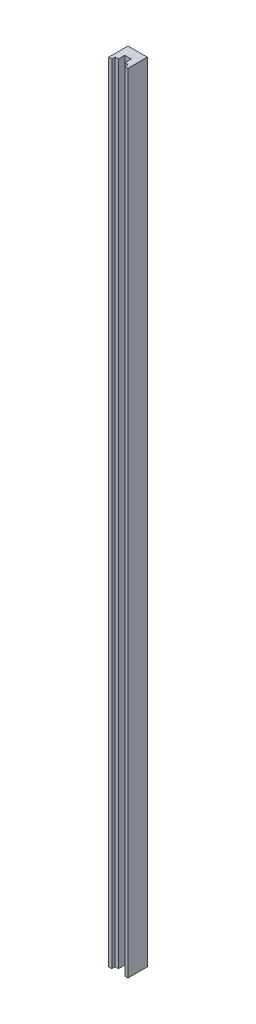
ISO-10303-21;
HEADER;
FILE_DESCRIPTION(('STEP AP214'),'2;1');
FILE_NAME('part.step','',(''),(''),'','','');
FILE_SCHEMA(('AUTOMOTIVE_DESIGN { 1 0 10303 214 1 1 1 1 }'));
ENDSEC;
DATA;
#1=APPLICATION_CONTEXT('core data for automotive mechanical design processes');
#2=APPLICATION_PROTOCOL_DEFINITION('international standard','automotive_design',2000,#1);
#3=PRODUCT_CONTEXT('',#1,'mechanical');
#4=PRODUCT('Part','Part','',(#3));
#5=PRODUCT_RELATED_PRODUCT_CATEGORY('part','',(#4));
#6=PRODUCT_DEFINITION_FORMATION('','',#4);
#7=PRODUCT_DEFINITION_CONTEXT('part definition',#1,'design');
#8=PRODUCT_DEFINITION('design','',#6,#7);
#9=PRODUCT_DEFINITION_SHAPE('','',#8);
#10=(LENGTH_UNIT() NAMED_UNIT(*) SI_UNIT(.MILLI.,.METRE.));
#11=(NAMED_UNIT(*) PLANE_ANGLE_UNIT() SI_UNIT($,.RADIAN.));
#12=(NAMED_UNIT(*) SI_UNIT($,.STERADIAN.) SOLID_ANGLE_UNIT());
#13=UNCERTAINTY_MEASURE_WITH_UNIT(LENGTH_MEASURE(1.E-05),#10,'distance_accuracy_value','');
#14=(GEOMETRIC_REPRESENTATION_CONTEXT(3) GLOBAL_UNCERTAINTY_ASSIGNED_CONTEXT((#13)) GLOBAL_UNIT_ASSIGNED_CONTEXT((#10,
#11,#12)) REPRESENTATION_CONTEXT('',''));
#15=CARTESIAN_POINT('',(0.,0.,0.));
#16=DIRECTION('',(0.,0.,1.));
#17=DIRECTION('',(1.,0.,0.));
#18=AXIS2_PLACEMENT_3D('',#15,#16,#17);
#19=CARTESIAN_POINT('',(-10.,-0.000999999999917733,9.99999999999999));
#20=DIRECTION('',(0.,0.,-1.));
#21=DIRECTION('',(-1.,0.,0.));
#22=AXIS2_PLACEMENT_3D('',#19,#20,#21);
#23=PLANE('',#22);
#24=DIRECTION('',(1.,0.,0.));
#25=VECTOR('',#24,1.);
#26=CARTESIAN_POINT('',(-10.,0.,9.99999999999999));
#27=LINE('',#26,#25);
#28=CARTESIAN_POINT('',(-10.,0.,9.99999999999999));
#29=VERTEX_POINT('',#28);
#30=CARTESIAN_POINT('',(-5.,0.,9.99999999999999));
#31=VERTEX_POINT('',#30);
#32=EDGE_CURVE('E143',#29,#31,#27,.T.);
#33=ORIENTED_EDGE('',*,*,#32,.T.);
#34=DIRECTION('',(0.,1.,0.));
#35=VECTOR('',#34,1.);
#36=CARTESIAN_POINT('',(-5.,-0.000999999999917733,9.99999999999999));
#37=LINE('',#36,#35);
#38=CARTESIAN_POINT('',(-5.,1225.,9.99999999999999));
#39=VERTEX_POINT('',#38);
#40=EDGE_CURVE('E126',#31,#39,#37,.T.);
#41=ORIENTED_EDGE('',*,*,#40,.T.);
#42=DIRECTION('',(-1.,0.,0.));
#43=VECTOR('',#42,1.);
#44=CARTESIAN_POINT('',(-10.,1225.,9.99999999999999));
#45=LINE('',#44,#43);
#46=CARTESIAN_POINT('',(-10.,1225.,9.99999999999999));
#47=VERTEX_POINT('',#46);
#48=EDGE_CURVE('E161',#39,#47,#45,.T.);
#49=ORIENTED_EDGE('',*,*,#48,.T.);
#50=DIRECTION('',(0.,1.,0.));
#51=VECTOR('',#50,1.);
#52=CARTESIAN_POINT('',(-10.,-0.000999999999917733,9.99999999999999));
#53=LINE('',#52,#51);
#54=EDGE_CURVE('E148',#29,#47,#53,.T.);
#55=ORIENTED_EDGE('',*,*,#54,.F.);
#56=EDGE_LOOP('',(#33,#41,#49,#55));
#57=FACE_BOUND('',#56,.T.);
#58=ADVANCED_FACE('F37',(#57),#23,.F.);
#59=CARTESIAN_POINT('',(15.,1225.,15.));
#60=DIRECTION('',(0.,0.,-1.));
#61=DIRECTION('',(-1.,0.,0.));
#62=AXIS2_PLACEMENT_3D('',#59,#60,#61);
#63=PLANE('',#62);
#64=DIRECTION('',(1.,0.,0.));
#65=VECTOR('',#64,1.);
#66=CARTESIAN_POINT('',(15.,0.,15.));
#67=LINE('',#66,#65);
#68=CARTESIAN_POINT('',(-15.,0.,15.));
#69=VERTEX_POINT('',#68);
#70=CARTESIAN_POINT('',(-10.,0.,15.));
#71=VERTEX_POINT('',#70);
#72=EDGE_CURVE('E190',#69,#71,#67,.T.);
#73=ORIENTED_EDGE('',*,*,#72,.T.);
#74=DIRECTION('',(0.,1.,0.));
#75=VECTOR('',#74,1.);
#76=CARTESIAN_POINT('',(-10.,-0.000999999999917733,15.));
#77=LINE('',#76,#75);
#78=CARTESIAN_POINT('',(-10.,1225.,15.));
#79=VERTEX_POINT('',#78);
#80=EDGE_CURVE('E165',#71,#79,#77,.T.);
#81=ORIENTED_EDGE('',*,*,#80,.T.);
#82=DIRECTION('',(1.,0.,0.));
#83=VECTOR('',#82,1.);
#84=CARTESIAN_POINT('',(15.,1225.,15.));
#85=LINE('',#84,#83);
#86=CARTESIAN_POINT('',(-15.,1225.,15.));
#87=VERTEX_POINT('',#86);
#88=EDGE_CURVE('E179',#87,#79,#85,.T.);
#89=ORIENTED_EDGE('',*,*,#88,.F.);
#90=DIRECTION('',(0.,-1.,0.));
#91=VECTOR('',#90,1.);
#92=CARTESIAN_POINT('',(-15.,1225.,15.));
#93=LINE('',#92,#91);
#94=EDGE_CURVE('E11',#87,#69,#93,.T.);
#95=ORIENTED_EDGE('',*,*,#94,.T.);
#96=EDGE_LOOP('',(#73,#81,#89,#95));
#97=FACE_BOUND('',#96,.T.);
#98=ADVANCED_FACE('F255',(#97),#63,.F.);
#99=CARTESIAN_POINT('',(-15.,1225.,15.));
#100=DIRECTION('',(1.,0.,0.));
#101=DIRECTION('',(0.,0.,-1.));
#102=AXIS2_PLACEMENT_3D('',#99,#100,#101);
#103=PLANE('',#102);
#104=DIRECTION('',(0.,0.,1.));
#105=VECTOR('',#104,1.);
#106=CARTESIAN_POINT('',(-15.,0.,15.));
#107=LINE('',#106,#105);
#108=CARTESIAN_POINT('',(-15.,0.,-15.));
#109=VERTEX_POINT('',#108);
#110=EDGE_CURVE('E167',#109,#69,#107,.T.);
#111=ORIENTED_EDGE('',*,*,#110,.T.);
#112=ORIENTED_EDGE('',*,*,#94,.F.);
#113=DIRECTION('',(0.,0.,1.));
#114=VECTOR('',#113,1.);
#115=CARTESIAN_POINT('',(-15.,1225.,15.));
#116=LINE('',#115,#114);
#117=CARTESIAN_POINT('',(-15.,1225.,-15.));
#118=VERTEX_POINT('',#117);
#119=EDGE_CURVE('E174',#118,#87,#116,.T.);
#120=ORIENTED_EDGE('',*,*,#119,.F.);
#121=DIRECTION('',(0.,-1.,0.));
#122=VECTOR('',#121,1.);
#123=CARTESIAN_POINT('',(-15.,1225.,-15.));
#124=LINE('',#123,#122);
#125=EDGE_CURVE('E186',#118,#109,#124,.T.);
#126=ORIENTED_EDGE('',*,*,#125,.T.);
#127=EDGE_LOOP('',(#111,#112,#120,#126));
#128=FACE_BOUND('',#127,.T.);
#129=ADVANCED_FACE('F39',(#128),#103,.F.);
#130=CARTESIAN_POINT('',(9.99999999999999,1225.,15.));
#131=VERTEX_POINT('',#130);
#132=CARTESIAN_POINT('',(15.,1225.,15.));
#133=VERTEX_POINT('',#132);
#134=EDGE_CURVE('E177',#131,#133,#85,.T.);
#135=ORIENTED_EDGE('',*,*,#134,.F.);
#136=DIRECTION('',(0.,1.,0.));
#137=VECTOR('',#136,1.);
#138=CARTESIAN_POINT('',(9.99999999999999,-0.000999999999917733,15.));
#139=LINE('',#138,#137);
#140=CARTESIAN_POINT('',(9.99999999999999,0.,15.));
#141=VERTEX_POINT('',#140);
#142=EDGE_CURVE('E170',#141,#131,#139,.T.);
#143=ORIENTED_EDGE('',*,*,#142,.F.);
#144=CARTESIAN_POINT('',(15.,0.,15.));
#145=VERTEX_POINT('',#144);
#146=EDGE_CURVE('E189',#141,#145,#67,.T.);
#147=ORIENTED_EDGE('',*,*,#146,.T.);
#148=DIRECTION('',(0.,-1.,0.));
#149=VECTOR('',#148,1.);
#150=CARTESIAN_POINT('',(15.,1225.,15.));
#151=LINE('',#150,#149);
#152=EDGE_CURVE('E45',#133,#145,#151,.T.);
#153=ORIENTED_EDGE('',*,*,#152,.F.);
#154=EDGE_LOOP('',(#135,#143,#147,#153));
#155=FACE_BOUND('',#154,.T.);
#156=ADVANCED_FACE('F226',(#155),#63,.F.);
#157=CARTESIAN_POINT('',(15.,1225.,15.));
#158=DIRECTION('',(-1.,0.,0.));
#159=DIRECTION('',(0.,0.,1.));
#160=AXIS2_PLACEMENT_3D('',#157,#158,#159);
#161=PLANE('',#160);
#162=DIRECTION('',(0.,0.,-1.));
#163=VECTOR('',#162,1.);
#164=CARTESIAN_POINT('',(15.,0.,15.));
#165=LINE('',#164,#163);
#166=CARTESIAN_POINT('',(15.,0.,-15.));
#167=VERTEX_POINT('',#166);
#168=EDGE_CURVE('E193',#145,#167,#165,.T.);
#169=ORIENTED_EDGE('',*,*,#168,.T.);
#170=DIRECTION('',(0.,-1.,0.));
#171=VECTOR('',#170,1.);
#172=CARTESIAN_POINT('',(15.,1225.,-15.));
#173=LINE('',#172,#171);
#174=CARTESIAN_POINT('',(15.,1225.,-15.));
#175=VERTEX_POINT('',#174);
#176=EDGE_CURVE('E198',#175,#167,#173,.T.);
#177=ORIENTED_EDGE('',*,*,#176,.F.);
#178=DIRECTION('',(0.,0.,-1.));
#179=VECTOR('',#178,1.);
#180=CARTESIAN_POINT('',(15.,1225.,15.));
#181=LINE('',#180,#179);
#182=EDGE_CURVE('E182',#133,#175,#181,.T.);
#183=ORIENTED_EDGE('',*,*,#182,.F.);
#184=ORIENTED_EDGE('',*,*,#152,.T.);
#185=EDGE_LOOP('',(#169,#177,#183,#184));
#186=FACE_BOUND('',#185,.T.);
#187=ADVANCED_FACE('F205',(#186),#161,.F.);
#188=CARTESIAN_POINT('',(15.,1225.,-15.));
#189=DIRECTION('',(0.,0.,1.));
#190=DIRECTION('',(1.,0.,0.));
#191=AXIS2_PLACEMENT_3D('',#188,#189,#190);
#192=PLANE('',#191);
#193=CARTESIAN_POINT('',(0.,75.,-15.));
#194=DIRECTION('',(0.,0.,-1.));
#195=DIRECTION('',(-1.,0.,0.));
#196=AXIS2_PLACEMENT_3D('',#193,#194,#195);
#197=CIRCLE('',#196,2.49999999999999);
#198=CARTESIAN_POINT('',(-2.49999999999999,75.,-15.));
#199=VERTEX_POINT('',#198);
#200=EDGE_CURVE('E655',#199,#199,#197,.T.);
#201=ORIENTED_EDGE('',*,*,#200,.F.);
#202=EDGE_LOOP('',(#201));
#203=FACE_BOUND('',#202,.T.);
#204=CARTESIAN_POINT('',(0.,25.,-15.));
#205=DIRECTION('',(0.,0.,-1.));
#206=DIRECTION('',(-1.,0.,0.));
#207=AXIS2_PLACEMENT_3D('',#204,#205,#206);
#208=CIRCLE('',#207,2.49999999999999);
#209=CARTESIAN_POINT('',(-2.5,25.,-15.));
#210=VERTEX_POINT('',#209);
#211=EDGE_CURVE('E657',#210,#210,#208,.T.);
#212=ORIENTED_EDGE('',*,*,#211,.F.);
#213=EDGE_LOOP('',(#212));
#214=FACE_BOUND('',#213,.T.);
#215=CARTESIAN_POINT('',(0.,250.,-15.));
#216=DIRECTION('',(0.,0.,-1.));
#217=DIRECTION('',(-1.,0.,0.));
#218=AXIS2_PLACEMENT_3D('',#215,#216,#217);
#219=CIRCLE('',#218,4.00000000000006);
#220=CARTESIAN_POINT('',(-4.00000000000007,250.,-15.));
#221=VERTEX_POINT('',#220);
#222=EDGE_CURVE('E665',#221,#221,#219,.T.);
#223=ORIENTED_EDGE('',*,*,#222,.F.);
#224=EDGE_LOOP('',(#223));
#225=FACE_BOUND('',#224,.T.);
#226=CARTESIAN_POINT('',(0.,300.,-15.));
#227=DIRECTION('',(0.,0.,-1.));
#228=DIRECTION('',(-1.,0.,0.));
#229=AXIS2_PLACEMENT_3D('',#226,#227,#228);
#230=CIRCLE('',#229,4.00000000000006);
#231=CARTESIAN_POINT('',(-4.00000000000007,300.,-15.));
#232=VERTEX_POINT('',#231);
#233=EDGE_CURVE('E669',#232,#232,#230,.T.);
#234=ORIENTED_EDGE('',*,*,#233,.F.);
#235=EDGE_LOOP('',(#234));
#236=FACE_BOUND('',#235,.T.);
#237=CARTESIAN_POINT('',(0.,350.,-15.));
#238=DIRECTION('',(0.,0.,-1.));
#239=DIRECTION('',(-1.,0.,0.));
#240=AXIS2_PLACEMENT_3D('',#237,#238,#239);
#241=CIRCLE('',#240,4.00000000000006);
#242=CARTESIAN_POINT('',(-4.00000000000007,350.,-15.));
#243=VERTEX_POINT('',#242);
#244=EDGE_CURVE('E675',#243,#243,#241,.T.);
#245=ORIENTED_EDGE('',*,*,#244,.F.);
#246=EDGE_LOOP('',(#245));
#247=FACE_BOUND('',#246,.T.);
#248=CARTESIAN_POINT('',(0.,400.,-15.));
#249=DIRECTION('',(0.,0.,-1.));
#250=DIRECTION('',(-1.,0.,0.));
#251=AXIS2_PLACEMENT_3D('',#248,#249,#250);
#252=CIRCLE('',#251,4.00000000000007);
#253=CARTESIAN_POINT('',(-4.00000000000008,400.,-15.));
#254=VERTEX_POINT('',#253);
#255=EDGE_CURVE('E681',#254,#254,#252,.T.);
#256=ORIENTED_EDGE('',*,*,#255,.F.);
#257=EDGE_LOOP('',(#256));
#258=FACE_BOUND('',#257,.T.);
#259=CARTESIAN_POINT('',(0.,450.,-15.));
#260=DIRECTION('',(0.,0.,-1.));
#261=DIRECTION('',(-1.,0.,0.));
#262=AXIS2_PLACEMENT_3D('',#259,#260,#261);
#263=CIRCLE('',#262,4.00000000000006);
#264=CARTESIAN_POINT('',(-4.00000000000007,450.,-15.));
#265=VERTEX_POINT('',#264);
#266=EDGE_CURVE('E687',#265,#265,#263,.T.);
#267=ORIENTED_EDGE('',*,*,#266,.F.);
#268=EDGE_LOOP('',(#267));
#269=FACE_BOUND('',#268,.T.);
#270=CARTESIAN_POINT('',(0.,500.,-15.));
#271=DIRECTION('',(0.,0.,-1.));
#272=DIRECTION('',(-1.,0.,0.));
#273=AXIS2_PLACEMENT_3D('',#270,#271,#272);
#274=CIRCLE('',#273,4.00000000000008);
#275=CARTESIAN_POINT('',(-4.00000000000008,500.,-15.));
#276=VERTEX_POINT('',#275);
#277=EDGE_CURVE('E693',#276,#276,#274,.T.);
#278=ORIENTED_EDGE('',*,*,#277,.F.);
#279=EDGE_LOOP('',(#278));
#280=FACE_BOUND('',#279,.T.);
#281=CARTESIAN_POINT('',(0.,550.,-15.));
#282=DIRECTION('',(0.,0.,-1.));
#283=DIRECTION('',(-1.,0.,0.));
#284=AXIS2_PLACEMENT_3D('',#281,#282,#283);
#285=CIRCLE('',#284,4.00000000000006);
#286=CARTESIAN_POINT('',(-4.00000000000007,550.,-15.));
#287=VERTEX_POINT('',#286);
#288=EDGE_CURVE('E699',#287,#287,#285,.T.);
#289=ORIENTED_EDGE('',*,*,#288,.F.);
#290=EDGE_LOOP('',(#289));
#291=FACE_BOUND('',#290,.T.);
#292=CARTESIAN_POINT('',(0.,600.,-15.));
#293=DIRECTION('',(0.,0.,-1.));
#294=DIRECTION('',(-1.,0.,0.));
#295=AXIS2_PLACEMENT_3D('',#292,#293,#294);
#296=CIRCLE('',#295,4.00000000000006);
#297=CARTESIAN_POINT('',(-4.00000000000007,600.,-15.));
#298=VERTEX_POINT('',#297);
#299=EDGE_CURVE('E705',#298,#298,#296,.T.);
#300=ORIENTED_EDGE('',*,*,#299,.F.);
#301=EDGE_LOOP('',(#300));
#302=FACE_BOUND('',#301,.T.);
#303=CARTESIAN_POINT('',(0.,650.,-15.));
#304=DIRECTION('',(0.,0.,-1.));
#305=DIRECTION('',(-1.,0.,0.));
#306=AXIS2_PLACEMENT_3D('',#303,#304,#305);
#307=CIRCLE('',#306,4.00000000000006);
#308=CARTESIAN_POINT('',(-4.00000000000007,650.,-15.));
#309=VERTEX_POINT('',#308);
#310=EDGE_CURVE('E711',#309,#309,#307,.T.);
#311=ORIENTED_EDGE('',*,*,#310,.F.);
#312=EDGE_LOOP('',(#311));
#313=FACE_BOUND('',#312,.T.);
#314=CARTESIAN_POINT('',(0.,700.,-15.));
#315=DIRECTION('',(0.,0.,-1.));
#316=DIRECTION('',(-1.,0.,0.));
#317=AXIS2_PLACEMENT_3D('',#314,#315,#316);
#318=CIRCLE('',#317,4.00000000000007);
#319=CARTESIAN_POINT('',(-4.00000000000008,700.,-15.));
#320=VERTEX_POINT('',#319);
#321=EDGE_CURVE('E717',#320,#320,#318,.T.);
#322=ORIENTED_EDGE('',*,*,#321,.F.);
#323=EDGE_LOOP('',(#322));
#324=FACE_BOUND('',#323,.T.);
#325=CARTESIAN_POINT('',(0.,800.,-15.));
#326=DIRECTION('',(0.,0.,-1.));
#327=DIRECTION('',(-1.,0.,0.));
#328=AXIS2_PLACEMENT_3D('',#325,#326,#327);
#329=CIRCLE('',#328,4.00000000000007);
#330=CARTESIAN_POINT('',(-4.00000000000008,800.,-15.));
#331=VERTEX_POINT('',#330);
#332=EDGE_CURVE('E723',#331,#331,#329,.T.);
#333=ORIENTED_EDGE('',*,*,#332,.F.);
#334=EDGE_LOOP('',(#333));
#335=FACE_BOUND('',#334,.T.);
#336=CARTESIAN_POINT('',(0.,200.,-15.));
#337=DIRECTION('',(0.,0.,-1.));
#338=DIRECTION('',(-1.,0.,0.));
#339=AXIS2_PLACEMENT_3D('',#336,#337,#338);
#340=CIRCLE('',#339,4.00000000000007);
#341=CARTESIAN_POINT('',(-4.00000000000008,200.,-15.));
#342=VERTEX_POINT('',#341);
#343=EDGE_CURVE('E729',#342,#342,#340,.T.);
#344=ORIENTED_EDGE('',*,*,#343,.F.);
#345=EDGE_LOOP('',(#344));
#346=FACE_BOUND('',#345,.T.);
#347=CARTESIAN_POINT('',(0.,1000.,-15.));
#348=DIRECTION('',(0.,0.,-1.));
#349=DIRECTION('',(-1.,0.,0.));
#350=AXIS2_PLACEMENT_3D('',#347,#348,#349);
#351=CIRCLE('',#350,4.00000000000007);
#352=CARTESIAN_POINT('',(-4.00000000000008,1000.,-15.));
#353=VERTEX_POINT('',#352);
#354=EDGE_CURVE('E735',#353,#353,#351,.T.);
#355=ORIENTED_EDGE('',*,*,#354,.F.);
#356=EDGE_LOOP('',(#355));
#357=FACE_BOUND('',#356,.T.);
#358=CARTESIAN_POINT('',(0.,1200.,-15.));
#359=DIRECTION('',(0.,0.,-1.));
#360=DIRECTION('',(-1.,0.,0.));
#361=AXIS2_PLACEMENT_3D('',#358,#359,#360);
#362=CIRCLE('',#361,4.00000000000006);
#363=CARTESIAN_POINT('',(-4.00000000000007,1200.,-15.));
#364=VERTEX_POINT('',#363);
#365=EDGE_CURVE('E741',#364,#364,#362,.T.);
#366=ORIENTED_EDGE('',*,*,#365,.F.);
#367=EDGE_LOOP('',(#366));
#368=FACE_BOUND('',#367,.T.);
#369=DIRECTION('',(-1.,0.,0.));
#370=VECTOR('',#369,1.);
#371=CARTESIAN_POINT('',(15.,0.,-15.));
#372=LINE('',#371,#370);
#373=EDGE_CURVE('E178',#167,#109,#372,.T.);
#374=ORIENTED_EDGE('',*,*,#373,.T.);
#375=ORIENTED_EDGE('',*,*,#125,.F.);
#376=DIRECTION('',(-1.,0.,0.));
#377=VECTOR('',#376,1.);
#378=CARTESIAN_POINT('',(15.,1225.,-15.));
#379=LINE('',#378,#377);
#380=EDGE_CURVE('E184',#175,#118,#379,.T.);
#381=ORIENTED_EDGE('',*,*,#380,.F.);
#382=ORIENTED_EDGE('',*,*,#176,.T.);
#383=EDGE_LOOP('',(#374,#375,#381,#382));
#384=FACE_BOUND('',#383,.T.);
#385=ADVANCED_FACE('F215',(#203,#214,#225,#236,#247,#258,#269,#280,#291,#302,#313,#324,#335,
#346,#357,#368,#384),#192,.F.);
#386=CARTESIAN_POINT('',(-15.,1225.,-15.));
#387=DIRECTION('',(0.,1.,0.));
#388=DIRECTION('',(0.,0.,1.));
#389=AXIS2_PLACEMENT_3D('',#386,#387,#388);
#390=PLANE('',#389);
#391=DIRECTION('',(0.,0.,1.));
#392=VECTOR('',#391,1.);
#393=CARTESIAN_POINT('',(-5.,1225.,9.99999999999999));
#394=LINE('',#393,#392);
#395=CARTESIAN_POINT('',(-5.00000000000001,1225.,0.));
#396=VERTEX_POINT('',#395);
#397=EDGE_CURVE('E132',#396,#39,#394,.T.);
#398=ORIENTED_EDGE('',*,*,#397,.F.);
#399=DIRECTION('',(-1.,0.,0.));
#400=VECTOR('',#399,1.);
#401=CARTESIAN_POINT('',(-5.00000000000001,1225.,0.));
#402=LINE('',#401,#400);
#403=CARTESIAN_POINT('',(4.99999999999999,1225.,0.));
#404=VERTEX_POINT('',#403);
#405=EDGE_CURVE('E137',#404,#396,#402,.T.);
#406=ORIENTED_EDGE('',*,*,#405,.F.);
#407=DIRECTION('',(0.,0.,-1.));
#408=VECTOR('',#407,1.);
#409=CARTESIAN_POINT('',(4.99999999999999,1225.,9.99999999999999));
#410=LINE('',#409,#408);
#411=CARTESIAN_POINT('',(4.99999999999999,1225.,9.99999999999999));
#412=VERTEX_POINT('',#411);
#413=EDGE_CURVE('E240',#412,#404,#410,.T.);
#414=ORIENTED_EDGE('',*,*,#413,.F.);
#415=CARTESIAN_POINT('',(9.99999999999999,1225.,9.99999999999999));
#416=VERTEX_POINT('',#415);
#417=EDGE_CURVE('E162',#416,#412,#45,.T.);
#418=ORIENTED_EDGE('',*,*,#417,.F.);
#419=DIRECTION('',(0.,0.,-1.));
#420=VECTOR('',#419,1.);
#421=CARTESIAN_POINT('',(9.99999999999999,1225.,15.));
#422=LINE('',#421,#420);
#423=EDGE_CURVE('E158',#131,#416,#422,.T.);
#424=ORIENTED_EDGE('',*,*,#423,.F.);
#425=ORIENTED_EDGE('',*,*,#134,.T.);
#426=ORIENTED_EDGE('',*,*,#182,.T.);
#427=ORIENTED_EDGE('',*,*,#380,.T.);
#428=ORIENTED_EDGE('',*,*,#119,.T.);
#429=ORIENTED_EDGE('',*,*,#88,.T.);
#430=DIRECTION('',(0.,0.,1.));
#431=VECTOR('',#430,1.);
#432=CARTESIAN_POINT('',(-10.,1225.,15.));
#433=LINE('',#432,#431);
#434=EDGE_CURVE('E152',#47,#79,#433,.T.);
#435=ORIENTED_EDGE('',*,*,#434,.F.);
#436=ORIENTED_EDGE('',*,*,#48,.F.);
#437=EDGE_LOOP('',(#398,#406,#414,#418,#424,#425,#426,#427,#428,#429,#435,#436));
#438=FACE_BOUND('',#437,.T.);
#439=ADVANCED_FACE('F221',(#438),#390,.T.);
#440=CARTESIAN_POINT('',(-15.,0.,-15.));
#441=DIRECTION('',(0.,1.,0.));
#442=DIRECTION('',(0.,0.,1.));
#443=AXIS2_PLACEMENT_3D('',#440,#441,#442);
#444=PLANE('',#443);
#445=DIRECTION('',(1.,0.,0.));
#446=VECTOR('',#445,1.);
#447=CARTESIAN_POINT('',(-5.00000000000001,0.,0.));
#448=LINE('',#447,#446);
#449=CARTESIAN_POINT('',(-5.00000000000001,0.,0.));
#450=VERTEX_POINT('',#449);
#451=CARTESIAN_POINT('',(4.99999999999999,0.,0.));
#452=VERTEX_POINT('',#451);
#453=EDGE_CURVE('E145',#450,#452,#448,.T.);
#454=ORIENTED_EDGE('',*,*,#453,.F.);
#455=DIRECTION('',(0.,0.,-1.));
#456=VECTOR('',#455,1.);
#457=CARTESIAN_POINT('',(-5.,0.,9.99999999999999));
#458=LINE('',#457,#456);
#459=EDGE_CURVE('E129',#31,#450,#458,.T.);
#460=ORIENTED_EDGE('',*,*,#459,.F.);
#461=ORIENTED_EDGE('',*,*,#32,.F.);
#462=DIRECTION('',(0.,0.,-1.));
#463=VECTOR('',#462,1.);
#464=CARTESIAN_POINT('',(-10.,0.,15.));
#465=LINE('',#464,#463);
#466=EDGE_CURVE('E150',#71,#29,#465,.T.);
#467=ORIENTED_EDGE('',*,*,#466,.F.);
#468=ORIENTED_EDGE('',*,*,#72,.F.);
#469=ORIENTED_EDGE('',*,*,#110,.F.);
#470=ORIENTED_EDGE('',*,*,#373,.F.);
#471=ORIENTED_EDGE('',*,*,#168,.F.);
#472=ORIENTED_EDGE('',*,*,#146,.F.);
#473=DIRECTION('',(0.,0.,1.));
#474=VECTOR('',#473,1.);
#475=CARTESIAN_POINT('',(9.99999999999999,0.,15.));
#476=LINE('',#475,#474);
#477=CARTESIAN_POINT('',(9.99999999999999,0.,9.99999999999999));
#478=VERTEX_POINT('',#477);
#479=EDGE_CURVE('E154',#478,#141,#476,.T.);
#480=ORIENTED_EDGE('',*,*,#479,.F.);
#481=CARTESIAN_POINT('',(5.,0.,9.99999999999999));
#482=VERTEX_POINT('',#481);
#483=EDGE_CURVE('E59',#482,#478,#27,.T.);
#484=ORIENTED_EDGE('',*,*,#483,.F.);
#485=DIRECTION('',(0.,0.,1.));
#486=VECTOR('',#485,1.);
#487=CARTESIAN_POINT('',(4.99999999999999,0.,9.99999999999999));
#488=LINE('',#487,#486);
#489=EDGE_CURVE('E52',#452,#482,#488,.T.);
#490=ORIENTED_EDGE('',*,*,#489,.F.);
#491=EDGE_LOOP('',(#454,#460,#461,#467,#468,#469,#470,#471,#472,#480,#484,#490));
#492=FACE_BOUND('',#491,.T.);
#493=ADVANCED_FACE('F141',(#492),#444,.F.);
#494=CARTESIAN_POINT('',(-10.,-0.000999999999917733,15.));
#495=DIRECTION('',(-1.,0.,0.));
#496=DIRECTION('',(0.,0.,1.));
#497=AXIS2_PLACEMENT_3D('',#494,#495,#496);
#498=PLANE('',#497);
#499=ORIENTED_EDGE('',*,*,#466,.T.);
#500=ORIENTED_EDGE('',*,*,#54,.T.);
#501=ORIENTED_EDGE('',*,*,#434,.T.);
#502=ORIENTED_EDGE('',*,*,#80,.F.);
#503=EDGE_LOOP('',(#499,#500,#501,#502));
#504=FACE_BOUND('',#503,.T.);
#505=ADVANCED_FACE('F244',(#504),#498,.F.);
#506=ORIENTED_EDGE('',*,*,#417,.T.);
#507=DIRECTION('',(0.,1.,0.));
#508=VECTOR('',#507,1.);
#509=CARTESIAN_POINT('',(4.99999999999999,-0.000999999999917733,9.99999999999999));
#510=LINE('',#509,#508);
#511=EDGE_CURVE('E136',#482,#412,#510,.T.);
#512=ORIENTED_EDGE('',*,*,#511,.F.);
#513=ORIENTED_EDGE('',*,*,#483,.T.);
#514=DIRECTION('',(0.,1.,0.));
#515=VECTOR('',#514,1.);
#516=CARTESIAN_POINT('',(9.99999999999999,-0.000999999999917733,9.99999999999999));
#517=LINE('',#516,#515);
#518=EDGE_CURVE('E168',#478,#416,#517,.T.);
#519=ORIENTED_EDGE('',*,*,#518,.T.);
#520=EDGE_LOOP('',(#506,#512,#513,#519));
#521=FACE_BOUND('',#520,.T.);
#522=ADVANCED_FACE('F242',(#521),#23,.F.);
#523=CARTESIAN_POINT('',(9.99999999999999,-0.000999999999917733,15.));
#524=DIRECTION('',(1.,0.,0.));
#525=DIRECTION('',(0.,0.,-1.));
#526=AXIS2_PLACEMENT_3D('',#523,#524,#525);
#527=PLANE('',#526);
#528=ORIENTED_EDGE('',*,*,#479,.T.);
#529=ORIENTED_EDGE('',*,*,#142,.T.);
#530=ORIENTED_EDGE('',*,*,#423,.T.);
#531=ORIENTED_EDGE('',*,*,#518,.F.);
#532=EDGE_LOOP('',(#528,#529,#530,#531));
#533=FACE_BOUND('',#532,.T.);
#534=ADVANCED_FACE('F228',(#533),#527,.F.);
#535=CARTESIAN_POINT('',(-5.,-0.000999999999917733,9.99999999999999));
#536=DIRECTION('',(-1.,0.,0.));
#537=DIRECTION('',(0.,0.,1.));
#538=AXIS2_PLACEMENT_3D('',#535,#536,#537);
#539=PLANE('',#538);
#540=ORIENTED_EDGE('',*,*,#459,.T.);
#541=DIRECTION('',(0.,1.,0.));
#542=VECTOR('',#541,1.);
#543=CARTESIAN_POINT('',(-5.00000000000001,-0.000999999999917733,0.));
#544=LINE('',#543,#542);
#545=EDGE_CURVE('E229',#450,#396,#544,.T.);
#546=ORIENTED_EDGE('',*,*,#545,.T.);
#547=ORIENTED_EDGE('',*,*,#397,.T.);
#548=ORIENTED_EDGE('',*,*,#40,.F.);
#549=EDGE_LOOP('',(#540,#546,#547,#548));
#550=FACE_BOUND('',#549,.T.);
#551=ADVANCED_FACE('F128',(#550),#539,.F.);
#552=CARTESIAN_POINT('',(-5.00000000000001,-0.000999999999917733,0.));
#553=DIRECTION('',(0.,0.,-1.));
#554=DIRECTION('',(-1.,0.,0.));
#555=AXIS2_PLACEMENT_3D('',#552,#553,#554);
#556=PLANE('',#555);
#557=CARTESIAN_POINT('',(0.,75.,0.));
#558=DIRECTION('',(0.,0.,-1.));
#559=DIRECTION('',(-1.,0.,0.));
#560=AXIS2_PLACEMENT_3D('',#557,#558,#559);
#561=CIRCLE('',#560,2.49999999999999);
#562=CARTESIAN_POINT('',(-2.49999999999999,75.,0.));
#563=VERTEX_POINT('',#562);
#564=EDGE_CURVE('E652',#563,#563,#561,.T.);
#565=ORIENTED_EDGE('',*,*,#564,.T.);
#566=EDGE_LOOP('',(#565));
#567=FACE_BOUND('',#566,.T.);
#568=CARTESIAN_POINT('',(0.,25.,0.));
#569=DIRECTION('',(0.,0.,-1.));
#570=DIRECTION('',(-1.,0.,0.));
#571=AXIS2_PLACEMENT_3D('',#568,#569,#570);
#572=CIRCLE('',#571,2.49999999999999);
#573=CARTESIAN_POINT('',(-2.49999999999999,25.,0.));
#574=VERTEX_POINT('',#573);
#575=EDGE_CURVE('E662',#574,#574,#572,.T.);
#576=ORIENTED_EDGE('',*,*,#575,.T.);
#577=EDGE_LOOP('',(#576));
#578=FACE_BOUND('',#577,.T.);
#579=ORIENTED_EDGE('',*,*,#453,.T.);
#580=DIRECTION('',(0.,1.,0.));
#581=VECTOR('',#580,1.);
#582=CARTESIAN_POINT('',(4.99999999999999,-0.000999999999917733,0.));
#583=LINE('',#582,#581);
#584=EDGE_CURVE('E230',#452,#404,#583,.T.);
#585=ORIENTED_EDGE('',*,*,#584,.T.);
#586=ORIENTED_EDGE('',*,*,#405,.T.);
#587=ORIENTED_EDGE('',*,*,#545,.F.);
#588=EDGE_LOOP('',(#579,#585,#586,#587));
#589=FACE_BOUND('',#588,.T.);
#590=ADVANCED_FACE('F314',(#567,#578,#589),#556,.F.);
#591=CARTESIAN_POINT('',(4.99999999999999,-0.000999999999917733,9.99999999999999));
#592=DIRECTION('',(1.,0.,0.));
#593=DIRECTION('',(0.,0.,-1.));
#594=AXIS2_PLACEMENT_3D('',#591,#592,#593);
#595=PLANE('',#594);
#596=ORIENTED_EDGE('',*,*,#489,.T.);
#597=ORIENTED_EDGE('',*,*,#511,.T.);
#598=ORIENTED_EDGE('',*,*,#413,.T.);
#599=ORIENTED_EDGE('',*,*,#584,.F.);
#600=EDGE_LOOP('',(#596,#597,#598,#599));
#601=FACE_BOUND('',#600,.T.);
#602=ADVANCED_FACE('F239',(#601),#595,.F.);
#603=CARTESIAN_POINT('',(0.,1200.,-12.));
#604=DIRECTION('',(0.,0.,-1.));
#605=DIRECTION('',(-1.,0.,0.));
#606=AXIS2_PLACEMENT_3D('',#603,#604,#605);
#607=CYLINDRICAL_SURFACE('',#606,4.00000000000006);
#608=CARTESIAN_POINT('',(0.,1200.,-12.));
#609=DIRECTION('',(0.,0.,-1.));
#610=DIRECTION('',(-1.,0.,0.));
#611=AXIS2_PLACEMENT_3D('',#608,#609,#610);
#612=CIRCLE('',#611,4.00000000000006);
#613=CARTESIAN_POINT('',(-4.00000000000007,1200.,-12.));
#614=VERTEX_POINT('',#613);
#615=EDGE_CURVE('E744',#614,#614,#612,.T.);
#616=ORIENTED_EDGE('',*,*,#615,.F.);
#617=EDGE_LOOP('',(#616));
#618=FACE_BOUND('',#617,.T.);
#619=ORIENTED_EDGE('',*,*,#365,.T.);
#620=EDGE_LOOP('',(#619));
#621=FACE_BOUND('',#620,.T.);
#622=ADVANCED_FACE('F329',(#618,#621),#607,.F.);
#623=CARTESIAN_POINT('',(0.,1200.,-12.));
#624=DIRECTION('',(0.,0.,-1.));
#625=DIRECTION('',(-1.,0.,0.));
#626=AXIS2_PLACEMENT_3D('',#623,#624,#625);
#627=PLANE('',#626);
#628=ORIENTED_EDGE('',*,*,#615,.T.);
#629=EDGE_LOOP('',(#628));
#630=FACE_BOUND('',#629,.T.);
#631=ADVANCED_FACE('F337',(#630),#627,.T.);
#632=CARTESIAN_POINT('',(0.,1000.,-12.));
#633=DIRECTION('',(0.,0.,-1.));
#634=DIRECTION('',(-1.,0.,0.));
#635=AXIS2_PLACEMENT_3D('',#632,#633,#634);
#636=CYLINDRICAL_SURFACE('',#635,4.00000000000007);
#637=CARTESIAN_POINT('',(0.,1000.,-12.));
#638=DIRECTION('',(0.,0.,-1.));
#639=DIRECTION('',(-1.,0.,0.));
#640=AXIS2_PLACEMENT_3D('',#637,#638,#639);
#641=CIRCLE('',#640,4.00000000000007);
#642=CARTESIAN_POINT('',(-4.00000000000008,1000.,-12.));
#643=VERTEX_POINT('',#642);
#644=EDGE_CURVE('E738',#643,#643,#641,.T.);
#645=ORIENTED_EDGE('',*,*,#644,.F.);
#646=EDGE_LOOP('',(#645));
#647=FACE_BOUND('',#646,.T.);
#648=ORIENTED_EDGE('',*,*,#354,.T.);
#649=EDGE_LOOP('',(#648));
#650=FACE_BOUND('',#649,.T.);
#651=ADVANCED_FACE('F346',(#647,#650),#636,.F.);
#652=CARTESIAN_POINT('',(0.,1000.,-12.));
#653=DIRECTION('',(0.,0.,-1.));
#654=DIRECTION('',(-1.,0.,0.));
#655=AXIS2_PLACEMENT_3D('',#652,#653,#654);
#656=PLANE('',#655);
#657=ORIENTED_EDGE('',*,*,#644,.T.);
#658=EDGE_LOOP('',(#657));
#659=FACE_BOUND('',#658,.T.);
#660=ADVANCED_FACE('F355',(#659),#656,.T.);
#661=CARTESIAN_POINT('',(0.,200.,-12.));
#662=DIRECTION('',(0.,0.,-1.));
#663=DIRECTION('',(-1.,0.,0.));
#664=AXIS2_PLACEMENT_3D('',#661,#662,#663);
#665=CYLINDRICAL_SURFACE('',#664,4.00000000000007);
#666=CARTESIAN_POINT('',(0.,200.,-12.));
#667=DIRECTION('',(0.,0.,-1.));
#668=DIRECTION('',(-1.,0.,0.));
#669=AXIS2_PLACEMENT_3D('',#666,#667,#668);
#670=CIRCLE('',#669,4.00000000000007);
#671=CARTESIAN_POINT('',(-4.00000000000008,200.,-12.));
#672=VERTEX_POINT('',#671);
#673=EDGE_CURVE('E732',#672,#672,#670,.T.);
#674=ORIENTED_EDGE('',*,*,#673,.F.);
#675=EDGE_LOOP('',(#674));
#676=FACE_BOUND('',#675,.T.);
#677=ORIENTED_EDGE('',*,*,#343,.T.);
#678=EDGE_LOOP('',(#677));
#679=FACE_BOUND('',#678,.T.);
#680=ADVANCED_FACE('F364',(#676,#679),#665,.F.);
#681=CARTESIAN_POINT('',(0.,200.,-12.));
#682=DIRECTION('',(0.,0.,-1.));
#683=DIRECTION('',(-1.,0.,0.));
#684=AXIS2_PLACEMENT_3D('',#681,#682,#683);
#685=PLANE('',#684);
#686=ORIENTED_EDGE('',*,*,#673,.T.);
#687=EDGE_LOOP('',(#686));
#688=FACE_BOUND('',#687,.T.);
#689=ADVANCED_FACE('F373',(#688),#685,.T.);
#690=CARTESIAN_POINT('',(0.,800.,-12.));
#691=DIRECTION('',(0.,0.,-1.));
#692=DIRECTION('',(-1.,0.,0.));
#693=AXIS2_PLACEMENT_3D('',#690,#691,#692);
#694=CYLINDRICAL_SURFACE('',#693,4.00000000000007);
#695=CARTESIAN_POINT('',(0.,800.,-12.));
#696=DIRECTION('',(0.,0.,-1.));
#697=DIRECTION('',(-1.,0.,0.));
#698=AXIS2_PLACEMENT_3D('',#695,#696,#697);
#699=CIRCLE('',#698,4.00000000000007);
#700=CARTESIAN_POINT('',(-4.00000000000008,800.,-12.));
#701=VERTEX_POINT('',#700);
#702=EDGE_CURVE('E726',#701,#701,#699,.T.);
#703=ORIENTED_EDGE('',*,*,#702,.F.);
#704=EDGE_LOOP('',(#703));
#705=FACE_BOUND('',#704,.T.);
#706=ORIENTED_EDGE('',*,*,#332,.T.);
#707=EDGE_LOOP('',(#706));
#708=FACE_BOUND('',#707,.T.);
#709=ADVANCED_FACE('F382',(#705,#708),#694,.F.);
#710=CARTESIAN_POINT('',(0.,800.,-12.));
#711=DIRECTION('',(0.,0.,-1.));
#712=DIRECTION('',(-1.,0.,0.));
#713=AXIS2_PLACEMENT_3D('',#710,#711,#712);
#714=PLANE('',#713);
#715=ORIENTED_EDGE('',*,*,#702,.T.);
#716=EDGE_LOOP('',(#715));
#717=FACE_BOUND('',#716,.T.);
#718=ADVANCED_FACE('F391',(#717),#714,.T.);
#719=CARTESIAN_POINT('',(0.,700.,-12.));
#720=DIRECTION('',(0.,0.,-1.));
#721=DIRECTION('',(-1.,0.,0.));
#722=AXIS2_PLACEMENT_3D('',#719,#720,#721);
#723=CYLINDRICAL_SURFACE('',#722,4.00000000000007);
#724=CARTESIAN_POINT('',(0.,700.,-12.));
#725=DIRECTION('',(0.,0.,-1.));
#726=DIRECTION('',(-1.,0.,0.));
#727=AXIS2_PLACEMENT_3D('',#724,#725,#726);
#728=CIRCLE('',#727,4.00000000000007);
#729=CARTESIAN_POINT('',(-4.00000000000008,700.,-12.));
#730=VERTEX_POINT('',#729);
#731=EDGE_CURVE('E720',#730,#730,#728,.T.);
#732=ORIENTED_EDGE('',*,*,#731,.F.);
#733=EDGE_LOOP('',(#732));
#734=FACE_BOUND('',#733,.T.);
#735=ORIENTED_EDGE('',*,*,#321,.T.);
#736=EDGE_LOOP('',(#735));
#737=FACE_BOUND('',#736,.T.);
#738=ADVANCED_FACE('F400',(#734,#737),#723,.F.);
#739=CARTESIAN_POINT('',(0.,700.,-12.));
#740=DIRECTION('',(0.,0.,-1.));
#741=DIRECTION('',(-1.,0.,0.));
#742=AXIS2_PLACEMENT_3D('',#739,#740,#741);
#743=PLANE('',#742);
#744=ORIENTED_EDGE('',*,*,#731,.T.);
#745=EDGE_LOOP('',(#744));
#746=FACE_BOUND('',#745,.T.);
#747=ADVANCED_FACE('F409',(#746),#743,.T.);
#748=CARTESIAN_POINT('',(0.,650.,-12.));
#749=DIRECTION('',(0.,0.,-1.));
#750=DIRECTION('',(-1.,0.,0.));
#751=AXIS2_PLACEMENT_3D('',#748,#749,#750);
#752=CYLINDRICAL_SURFACE('',#751,4.00000000000006);
#753=CARTESIAN_POINT('',(0.,650.,-12.));
#754=DIRECTION('',(0.,0.,-1.));
#755=DIRECTION('',(-1.,0.,0.));
#756=AXIS2_PLACEMENT_3D('',#753,#754,#755);
#757=CIRCLE('',#756,4.00000000000006);
#758=CARTESIAN_POINT('',(-4.00000000000007,650.,-12.));
#759=VERTEX_POINT('',#758);
#760=EDGE_CURVE('E714',#759,#759,#757,.T.);
#761=ORIENTED_EDGE('',*,*,#760,.F.);
#762=EDGE_LOOP('',(#761));
#763=FACE_BOUND('',#762,.T.);
#764=ORIENTED_EDGE('',*,*,#310,.T.);
#765=EDGE_LOOP('',(#764));
#766=FACE_BOUND('',#765,.T.);
#767=ADVANCED_FACE('F418',(#763,#766),#752,.F.);
#768=CARTESIAN_POINT('',(0.,650.,-12.));
#769=DIRECTION('',(0.,0.,-1.));
#770=DIRECTION('',(-1.,0.,0.));
#771=AXIS2_PLACEMENT_3D('',#768,#769,#770);
#772=PLANE('',#771);
#773=ORIENTED_EDGE('',*,*,#760,.T.);
#774=EDGE_LOOP('',(#773));
#775=FACE_BOUND('',#774,.T.);
#776=ADVANCED_FACE('F427',(#775),#772,.T.);
#777=CARTESIAN_POINT('',(0.,600.,-12.));
#778=DIRECTION('',(0.,0.,-1.));
#779=DIRECTION('',(-1.,0.,0.));
#780=AXIS2_PLACEMENT_3D('',#777,#778,#779);
#781=CYLINDRICAL_SURFACE('',#780,4.00000000000006);
#782=CARTESIAN_POINT('',(0.,600.,-12.));
#783=DIRECTION('',(0.,0.,-1.));
#784=DIRECTION('',(-1.,0.,0.));
#785=AXIS2_PLACEMENT_3D('',#782,#783,#784);
#786=CIRCLE('',#785,4.00000000000006);
#787=CARTESIAN_POINT('',(-4.00000000000007,600.,-12.));
#788=VERTEX_POINT('',#787);
#789=EDGE_CURVE('E708',#788,#788,#786,.T.);
#790=ORIENTED_EDGE('',*,*,#789,.F.);
#791=EDGE_LOOP('',(#790));
#792=FACE_BOUND('',#791,.T.);
#793=ORIENTED_EDGE('',*,*,#299,.T.);
#794=EDGE_LOOP('',(#793));
#795=FACE_BOUND('',#794,.T.);
#796=ADVANCED_FACE('F436',(#792,#795),#781,.F.);
#797=CARTESIAN_POINT('',(0.,600.,-12.));
#798=DIRECTION('',(0.,0.,-1.));
#799=DIRECTION('',(-1.,0.,0.));
#800=AXIS2_PLACEMENT_3D('',#797,#798,#799);
#801=PLANE('',#800);
#802=ORIENTED_EDGE('',*,*,#789,.T.);
#803=EDGE_LOOP('',(#802));
#804=FACE_BOUND('',#803,.T.);
#805=ADVANCED_FACE('F445',(#804),#801,.T.);
#806=CARTESIAN_POINT('',(0.,550.,-12.));
#807=DIRECTION('',(0.,0.,-1.));
#808=DIRECTION('',(-1.,0.,0.));
#809=AXIS2_PLACEMENT_3D('',#806,#807,#808);
#810=CYLINDRICAL_SURFACE('',#809,4.00000000000006);
#811=CARTESIAN_POINT('',(0.,550.,-12.));
#812=DIRECTION('',(0.,0.,-1.));
#813=DIRECTION('',(-1.,0.,0.));
#814=AXIS2_PLACEMENT_3D('',#811,#812,#813);
#815=CIRCLE('',#814,4.00000000000006);
#816=CARTESIAN_POINT('',(-4.00000000000007,550.,-12.));
#817=VERTEX_POINT('',#816);
#818=EDGE_CURVE('E702',#817,#817,#815,.T.);
#819=ORIENTED_EDGE('',*,*,#818,.F.);
#820=EDGE_LOOP('',(#819));
#821=FACE_BOUND('',#820,.T.);
#822=ORIENTED_EDGE('',*,*,#288,.T.);
#823=EDGE_LOOP('',(#822));
#824=FACE_BOUND('',#823,.T.);
#825=ADVANCED_FACE('F454',(#821,#824),#810,.F.);
#826=CARTESIAN_POINT('',(0.,550.,-12.));
#827=DIRECTION('',(0.,0.,-1.));
#828=DIRECTION('',(-1.,0.,0.));
#829=AXIS2_PLACEMENT_3D('',#826,#827,#828);
#830=PLANE('',#829);
#831=ORIENTED_EDGE('',*,*,#818,.T.);
#832=EDGE_LOOP('',(#831));
#833=FACE_BOUND('',#832,.T.);
#834=ADVANCED_FACE('F463',(#833),#830,.T.);
#835=CARTESIAN_POINT('',(0.,500.,-12.));
#836=DIRECTION('',(0.,0.,-1.));
#837=DIRECTION('',(-1.,0.,0.));
#838=AXIS2_PLACEMENT_3D('',#835,#836,#837);
#839=CYLINDRICAL_SURFACE('',#838,4.00000000000008);
#840=CARTESIAN_POINT('',(0.,500.,-12.));
#841=DIRECTION('',(0.,0.,-1.));
#842=DIRECTION('',(-1.,0.,0.));
#843=AXIS2_PLACEMENT_3D('',#840,#841,#842);
#844=CIRCLE('',#843,4.00000000000008);
#845=CARTESIAN_POINT('',(-4.00000000000008,500.,-12.));
#846=VERTEX_POINT('',#845);
#847=EDGE_CURVE('E696',#846,#846,#844,.T.);
#848=ORIENTED_EDGE('',*,*,#847,.F.);
#849=EDGE_LOOP('',(#848));
#850=FACE_BOUND('',#849,.T.);
#851=ORIENTED_EDGE('',*,*,#277,.T.);
#852=EDGE_LOOP('',(#851));
#853=FACE_BOUND('',#852,.T.);
#854=ADVANCED_FACE('F472',(#850,#853),#839,.F.);
#855=CARTESIAN_POINT('',(0.,500.,-12.));
#856=DIRECTION('',(0.,0.,-1.));
#857=DIRECTION('',(-1.,0.,0.));
#858=AXIS2_PLACEMENT_3D('',#855,#856,#857);
#859=PLANE('',#858);
#860=ORIENTED_EDGE('',*,*,#847,.T.);
#861=EDGE_LOOP('',(#860));
#862=FACE_BOUND('',#861,.T.);
#863=ADVANCED_FACE('F481',(#862),#859,.T.);
#864=CARTESIAN_POINT('',(0.,450.,-12.));
#865=DIRECTION('',(0.,0.,-1.));
#866=DIRECTION('',(-1.,0.,0.));
#867=AXIS2_PLACEMENT_3D('',#864,#865,#866);
#868=CYLINDRICAL_SURFACE('',#867,4.00000000000006);
#869=CARTESIAN_POINT('',(0.,450.,-12.));
#870=DIRECTION('',(0.,0.,-1.));
#871=DIRECTION('',(-1.,0.,0.));
#872=AXIS2_PLACEMENT_3D('',#869,#870,#871);
#873=CIRCLE('',#872,4.00000000000006);
#874=CARTESIAN_POINT('',(-4.00000000000007,450.,-12.));
#875=VERTEX_POINT('',#874);
#876=EDGE_CURVE('E690',#875,#875,#873,.T.);
#877=ORIENTED_EDGE('',*,*,#876,.F.);
#878=EDGE_LOOP('',(#877));
#879=FACE_BOUND('',#878,.T.);
#880=ORIENTED_EDGE('',*,*,#266,.T.);
#881=EDGE_LOOP('',(#880));
#882=FACE_BOUND('',#881,.T.);
#883=ADVANCED_FACE('F490',(#879,#882),#868,.F.);
#884=CARTESIAN_POINT('',(0.,450.,-12.));
#885=DIRECTION('',(0.,0.,-1.));
#886=DIRECTION('',(-1.,0.,0.));
#887=AXIS2_PLACEMENT_3D('',#884,#885,#886);
#888=PLANE('',#887);
#889=ORIENTED_EDGE('',*,*,#876,.T.);
#890=EDGE_LOOP('',(#889));
#891=FACE_BOUND('',#890,.T.);
#892=ADVANCED_FACE('F499',(#891),#888,.T.);
#893=CARTESIAN_POINT('',(0.,400.,-12.));
#894=DIRECTION('',(0.,0.,-1.));
#895=DIRECTION('',(-1.,0.,0.));
#896=AXIS2_PLACEMENT_3D('',#893,#894,#895);
#897=CYLINDRICAL_SURFACE('',#896,4.00000000000007);
#898=CARTESIAN_POINT('',(0.,400.,-12.));
#899=DIRECTION('',(0.,0.,-1.));
#900=DIRECTION('',(-1.,0.,0.));
#901=AXIS2_PLACEMENT_3D('',#898,#899,#900);
#902=CIRCLE('',#901,4.00000000000007);
#903=CARTESIAN_POINT('',(-4.00000000000008,400.,-12.));
#904=VERTEX_POINT('',#903);
#905=EDGE_CURVE('E684',#904,#904,#902,.T.);
#906=ORIENTED_EDGE('',*,*,#905,.F.);
#907=EDGE_LOOP('',(#906));
#908=FACE_BOUND('',#907,.T.);
#909=ORIENTED_EDGE('',*,*,#255,.T.);
#910=EDGE_LOOP('',(#909));
#911=FACE_BOUND('',#910,.T.);
#912=ADVANCED_FACE('F508',(#908,#911),#897,.F.);
#913=CARTESIAN_POINT('',(0.,400.,-12.));
#914=DIRECTION('',(0.,0.,-1.));
#915=DIRECTION('',(-1.,0.,0.));
#916=AXIS2_PLACEMENT_3D('',#913,#914,#915);
#917=PLANE('',#916);
#918=ORIENTED_EDGE('',*,*,#905,.T.);
#919=EDGE_LOOP('',(#918));
#920=FACE_BOUND('',#919,.T.);
#921=ADVANCED_FACE('F517',(#920),#917,.T.);
#922=CARTESIAN_POINT('',(0.,350.,-12.));
#923=DIRECTION('',(0.,0.,-1.));
#924=DIRECTION('',(-1.,0.,0.));
#925=AXIS2_PLACEMENT_3D('',#922,#923,#924);
#926=CYLINDRICAL_SURFACE('',#925,4.00000000000006);
#927=CARTESIAN_POINT('',(0.,350.,-12.));
#928=DIRECTION('',(0.,0.,-1.));
#929=DIRECTION('',(-1.,0.,0.));
#930=AXIS2_PLACEMENT_3D('',#927,#928,#929);
#931=CIRCLE('',#930,4.00000000000006);
#932=CARTESIAN_POINT('',(-4.00000000000007,350.,-12.));
#933=VERTEX_POINT('',#932);
#934=EDGE_CURVE('E678',#933,#933,#931,.T.);
#935=ORIENTED_EDGE('',*,*,#934,.F.);
#936=EDGE_LOOP('',(#935));
#937=FACE_BOUND('',#936,.T.);
#938=ORIENTED_EDGE('',*,*,#244,.T.);
#939=EDGE_LOOP('',(#938));
#940=FACE_BOUND('',#939,.T.);
#941=ADVANCED_FACE('F526',(#937,#940),#926,.F.);
#942=CARTESIAN_POINT('',(0.,350.,-12.));
#943=DIRECTION('',(0.,0.,-1.));
#944=DIRECTION('',(-1.,0.,0.));
#945=AXIS2_PLACEMENT_3D('',#942,#943,#944);
#946=PLANE('',#945);
#947=ORIENTED_EDGE('',*,*,#934,.T.);
#948=EDGE_LOOP('',(#947));
#949=FACE_BOUND('',#948,.T.);
#950=ADVANCED_FACE('F535',(#949),#946,.T.);
#951=CARTESIAN_POINT('',(0.,300.,-12.));
#952=DIRECTION('',(0.,0.,-1.));
#953=DIRECTION('',(-1.,0.,0.));
#954=AXIS2_PLACEMENT_3D('',#951,#952,#953);
#955=CYLINDRICAL_SURFACE('',#954,4.00000000000006);
#956=CARTESIAN_POINT('',(0.,300.,-12.));
#957=DIRECTION('',(0.,0.,-1.));
#958=DIRECTION('',(-1.,0.,0.));
#959=AXIS2_PLACEMENT_3D('',#956,#957,#958);
#960=CIRCLE('',#959,4.00000000000006);
#961=CARTESIAN_POINT('',(-4.00000000000007,300.,-12.));
#962=VERTEX_POINT('',#961);
#963=EDGE_CURVE('E672',#962,#962,#960,.T.);
#964=ORIENTED_EDGE('',*,*,#963,.F.);
#965=EDGE_LOOP('',(#964));
#966=FACE_BOUND('',#965,.T.);
#967=ORIENTED_EDGE('',*,*,#233,.T.);
#968=EDGE_LOOP('',(#967));
#969=FACE_BOUND('',#968,.T.);
#970=ADVANCED_FACE('F544',(#966,#969),#955,.F.);
#971=CARTESIAN_POINT('',(0.,300.,-12.));
#972=DIRECTION('',(0.,0.,-1.));
#973=DIRECTION('',(-1.,0.,0.));
#974=AXIS2_PLACEMENT_3D('',#971,#972,#973);
#975=PLANE('',#974);
#976=ORIENTED_EDGE('',*,*,#963,.T.);
#977=EDGE_LOOP('',(#976));
#978=FACE_BOUND('',#977,.T.);
#979=ADVANCED_FACE('F553',(#978),#975,.T.);
#980=CARTESIAN_POINT('',(0.,250.,-12.));
#981=DIRECTION('',(0.,0.,-1.));
#982=DIRECTION('',(-1.,0.,0.));
#983=AXIS2_PLACEMENT_3D('',#980,#981,#982);
#984=CYLINDRICAL_SURFACE('',#983,4.00000000000006);
#985=CARTESIAN_POINT('',(0.,250.,-12.));
#986=DIRECTION('',(0.,0.,-1.));
#987=DIRECTION('',(-1.,0.,0.));
#988=AXIS2_PLACEMENT_3D('',#985,#986,#987);
#989=CIRCLE('',#988,4.00000000000006);
#990=CARTESIAN_POINT('',(-4.00000000000007,250.,-12.));
#991=VERTEX_POINT('',#990);
#992=EDGE_CURVE('E666',#991,#991,#989,.T.);
#993=ORIENTED_EDGE('',*,*,#992,.F.);
#994=EDGE_LOOP('',(#993));
#995=FACE_BOUND('',#994,.T.);
#996=ORIENTED_EDGE('',*,*,#222,.T.);
#997=EDGE_LOOP('',(#996));
#998=FACE_BOUND('',#997,.T.);
#999=ADVANCED_FACE('F562',(#995,#998),#984,.F.);
#1000=CARTESIAN_POINT('',(0.,250.,-12.));
#1001=DIRECTION('',(0.,0.,-1.));
#1002=DIRECTION('',(-1.,0.,0.));
#1003=AXIS2_PLACEMENT_3D('',#1000,#1001,#1002);
#1004=PLANE('',#1003);
#1005=ORIENTED_EDGE('',*,*,#992,.T.);
#1006=EDGE_LOOP('',(#1005));
#1007=FACE_BOUND('',#1006,.T.);
#1008=ADVANCED_FACE('F571',(#1007),#1004,.T.);
#1009=CARTESIAN_POINT('',(0.,25.,-15.));
#1010=DIRECTION('',(0.,0.,-1.));
#1011=DIRECTION('',(-1.,0.,0.));
#1012=AXIS2_PLACEMENT_3D('',#1009,#1010,#1011);
#1013=CYLINDRICAL_SURFACE('',#1012,2.49999999999999);
#1014=ORIENTED_EDGE('',*,*,#575,.F.);
#1015=EDGE_LOOP('',(#1014));
#1016=FACE_BOUND('',#1015,.T.);
#1017=ORIENTED_EDGE('',*,*,#211,.T.);
#1018=EDGE_LOOP('',(#1017));
#1019=FACE_BOUND('',#1018,.T.);
#1020=ADVANCED_FACE('F580',(#1016,#1019),#1013,.F.);
#1021=CARTESIAN_POINT('',(0.,75.,-15.));
#1022=DIRECTION('',(0.,0.,-1.));
#1023=DIRECTION('',(-1.,0.,0.));
#1024=AXIS2_PLACEMENT_3D('',#1021,#1022,#1023);
#1025=CYLINDRICAL_SURFACE('',#1024,2.49999999999999);
#1026=ORIENTED_EDGE('',*,*,#564,.F.);
#1027=EDGE_LOOP('',(#1026));
#1028=FACE_BOUND('',#1027,.T.);
#1029=ORIENTED_EDGE('',*,*,#200,.T.);
#1030=EDGE_LOOP('',(#1029));
#1031=FACE_BOUND('',#1030,.T.);
#1032=ADVANCED_FACE('F589',(#1028,#1031),#1025,.F.);
#1033=CLOSED_SHELL('',(#58,#98,#129,#156,#187,#385,#439,#493,#505,#522,#534,#551,#590,#602,#622,
#631,#651,#660,#680,#689,#709,#718,#738,#747,#767,#776,#796,#805,#825,#834,#854,#863,#883,#892,
#912,#921,#941,#950,#970,#979,#999,#1008,#1020,#1032));
#1034=MANIFOLD_SOLID_BREP('B2',#1033);
#1035=ADVANCED_BREP_SHAPE_REPRESENTATION('',(#18,#1034),#14);
#1036=SHAPE_DEFINITION_REPRESENTATION(#9,#1035);
ENDSEC;
END-ISO-10303-21;
